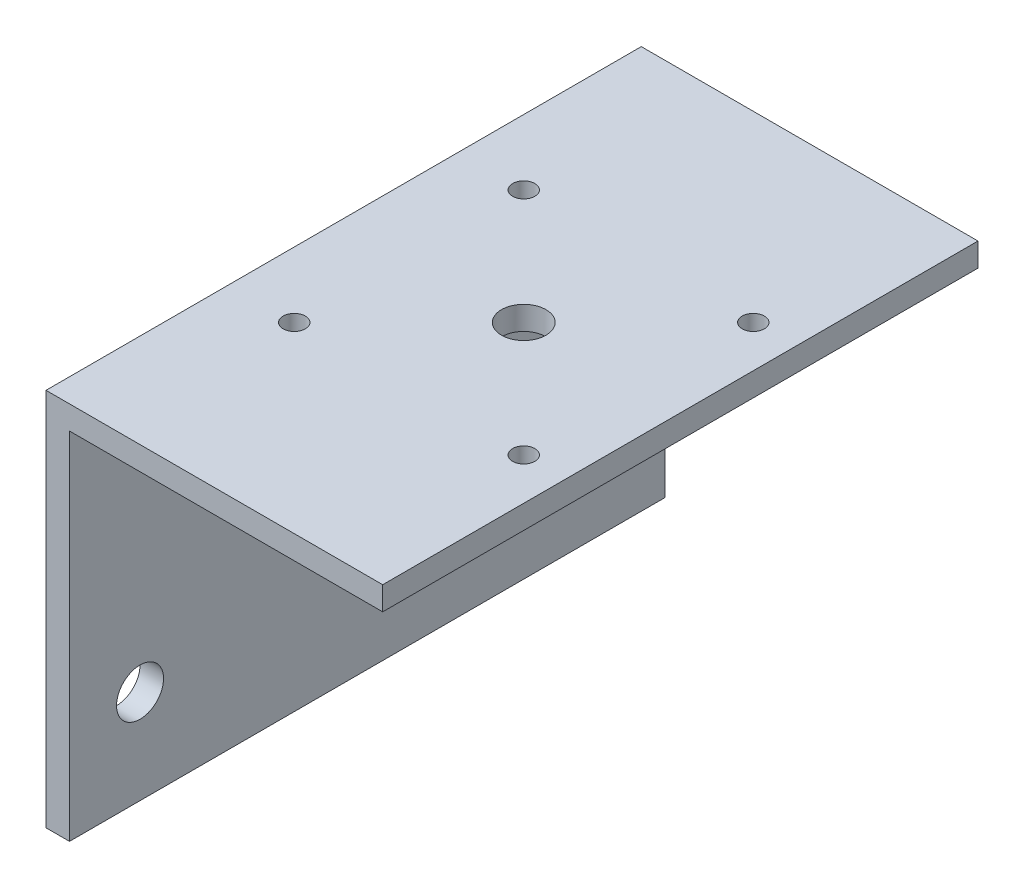
ISO-10303-21;
HEADER;
FILE_DESCRIPTION(('STEP AP214'),'2;1');
FILE_NAME('part.step','',(''),(''),'','','');
FILE_SCHEMA(('AUTOMOTIVE_DESIGN { 1 0 10303 214 1 1 1 1 }'));
ENDSEC;
DATA;
#1=APPLICATION_CONTEXT('core data for automotive mechanical design processes');
#2=APPLICATION_PROTOCOL_DEFINITION('international standard','automotive_design',2000,#1);
#3=PRODUCT_CONTEXT('',#1,'mechanical');
#4=PRODUCT('Part','Part','',(#3));
#5=PRODUCT_RELATED_PRODUCT_CATEGORY('part','',(#4));
#6=PRODUCT_DEFINITION_FORMATION('','',#4);
#7=PRODUCT_DEFINITION_CONTEXT('part definition',#1,'design');
#8=PRODUCT_DEFINITION('design','',#6,#7);
#9=PRODUCT_DEFINITION_SHAPE('','',#8);
#10=(LENGTH_UNIT() NAMED_UNIT(*) SI_UNIT(.MILLI.,.METRE.));
#11=(NAMED_UNIT(*) PLANE_ANGLE_UNIT() SI_UNIT($,.RADIAN.));
#12=(NAMED_UNIT(*) SI_UNIT($,.STERADIAN.) SOLID_ANGLE_UNIT());
#13=UNCERTAINTY_MEASURE_WITH_UNIT(LENGTH_MEASURE(1.E-05),#10,'distance_accuracy_value','');
#14=(GEOMETRIC_REPRESENTATION_CONTEXT(3) GLOBAL_UNCERTAINTY_ASSIGNED_CONTEXT((#13)) GLOBAL_UNIT_ASSIGNED_CONTEXT((#10,
#11,#12)) REPRESENTATION_CONTEXT('',''));
#15=CARTESIAN_POINT('',(0.,0.,0.));
#16=DIRECTION('',(0.,0.,1.));
#17=DIRECTION('',(1.,0.,0.));
#18=AXIS2_PLACEMENT_3D('',#15,#16,#17);
#19=CARTESIAN_POINT('',(0.,0.,80.4));
#20=DIRECTION('',(1.,0.,0.));
#21=DIRECTION('',(0.,0.,-1.));
#22=AXIS2_PLACEMENT_3D('',#19,#20,#21);
#23=PLANE('',#22);
#24=CARTESIAN_POINT('',(0.,12.7,9.52500000000001));
#25=DIRECTION('',(1.,0.,0.));
#26=DIRECTION('',(0.,0.,-1.));
#27=AXIS2_PLACEMENT_3D('',#24,#25,#26);
#28=CIRCLE('',#27,3.175);
#29=CARTESIAN_POINT('',(0.,12.7,6.35000000000001));
#30=VERTEX_POINT('',#29);
#31=EDGE_CURVE('E164',#30,#30,#28,.T.);
#32=ORIENTED_EDGE('',*,*,#31,.T.);
#33=EDGE_LOOP('',(#32));
#34=FACE_BOUND('',#33,.T.);
#35=CARTESIAN_POINT('',(0.,12.7,70.875));
#36=DIRECTION('',(1.,0.,0.));
#37=DIRECTION('',(0.,0.,-1.));
#38=AXIS2_PLACEMENT_3D('',#35,#36,#37);
#39=CIRCLE('',#38,3.175);
#40=CARTESIAN_POINT('',(0.,12.7,67.7));
#41=VERTEX_POINT('',#40);
#42=EDGE_CURVE('E122',#41,#41,#39,.T.);
#43=ORIENTED_EDGE('',*,*,#42,.T.);
#44=EDGE_LOOP('',(#43));
#45=FACE_BOUND('',#44,.T.);
#46=DIRECTION('',(0.,-1.,0.));
#47=VECTOR('',#46,1.);
#48=CARTESIAN_POINT('',(0.,0.,0.));
#49=LINE('',#48,#47);
#50=CARTESIAN_POINT('',(0.,51.175,0.));
#51=VERTEX_POINT('',#50);
#52=CARTESIAN_POINT('',(0.,0.,0.));
#53=VERTEX_POINT('',#52);
#54=EDGE_CURVE('E118',#51,#53,#49,.T.);
#55=ORIENTED_EDGE('',*,*,#54,.T.);
#56=DIRECTION('',(0.,0.,-1.));
#57=VECTOR('',#56,1.);
#58=CARTESIAN_POINT('',(0.,0.,80.4));
#59=LINE('',#58,#57);
#60=CARTESIAN_POINT('',(0.,0.,80.4));
#61=VERTEX_POINT('',#60);
#62=EDGE_CURVE('E11',#61,#53,#59,.T.);
#63=ORIENTED_EDGE('',*,*,#62,.F.);
#64=DIRECTION('',(0.,-1.,0.));
#65=VECTOR('',#64,1.);
#66=CARTESIAN_POINT('',(0.,0.,80.4));
#67=LINE('',#66,#65);
#68=CARTESIAN_POINT('',(0.,51.175,80.4));
#69=VERTEX_POINT('',#68);
#70=EDGE_CURVE('E129',#69,#61,#67,.T.);
#71=ORIENTED_EDGE('',*,*,#70,.F.);
#72=DIRECTION('',(0.,0.,-1.));
#73=VECTOR('',#72,1.);
#74=CARTESIAN_POINT('',(0.,51.175,80.4));
#75=LINE('',#74,#73);
#76=EDGE_CURVE('E114',#69,#51,#75,.T.);
#77=ORIENTED_EDGE('',*,*,#76,.T.);
#78=EDGE_LOOP('',(#55,#63,#71,#77));
#79=FACE_BOUND('',#78,.T.);
#80=ADVANCED_FACE('F34',(#34,#45,#79),#23,.F.);
#81=CARTESIAN_POINT('',(0.,0.,80.4));
#82=DIRECTION('',(0.,1.,0.));
#83=DIRECTION('',(-1.,0.,0.));
#84=AXIS2_PLACEMENT_3D('',#81,#82,#83);
#85=PLANE('',#84);
#86=DIRECTION('',(1.,0.,0.));
#87=VECTOR('',#86,1.);
#88=CARTESIAN_POINT('',(0.,0.,0.));
#89=LINE('',#88,#87);
#90=CARTESIAN_POINT('',(3.175,0.,0.));
#91=VERTEX_POINT('',#90);
#92=EDGE_CURVE('E121',#53,#91,#89,.T.);
#93=ORIENTED_EDGE('',*,*,#92,.T.);
#94=DIRECTION('',(0.,0.,-1.));
#95=VECTOR('',#94,1.);
#96=CARTESIAN_POINT('',(3.175,0.,80.4));
#97=LINE('',#96,#95);
#98=CARTESIAN_POINT('',(3.175,0.,80.4));
#99=VERTEX_POINT('',#98);
#100=EDGE_CURVE('E42',#99,#91,#97,.T.);
#101=ORIENTED_EDGE('',*,*,#100,.F.);
#102=DIRECTION('',(1.,0.,0.));
#103=VECTOR('',#102,1.);
#104=CARTESIAN_POINT('',(0.,0.,80.4));
#105=LINE('',#104,#103);
#106=EDGE_CURVE('E87',#61,#99,#105,.T.);
#107=ORIENTED_EDGE('',*,*,#106,.F.);
#108=ORIENTED_EDGE('',*,*,#62,.T.);
#109=EDGE_LOOP('',(#93,#101,#107,#108));
#110=FACE_BOUND('',#109,.T.);
#111=ADVANCED_FACE('F156',(#110),#85,.F.);
#112=CARTESIAN_POINT('',(3.175,0.,80.4));
#113=DIRECTION('',(-1.,0.,0.));
#114=DIRECTION('',(0.,0.,1.));
#115=AXIS2_PLACEMENT_3D('',#112,#113,#114);
#116=PLANE('',#115);
#117=CARTESIAN_POINT('',(3.175,12.7,9.52500000000001));
#118=DIRECTION('',(1.,0.,0.));
#119=DIRECTION('',(0.,0.,-1.));
#120=AXIS2_PLACEMENT_3D('',#117,#118,#119);
#121=CIRCLE('',#120,3.175);
#122=CARTESIAN_POINT('',(3.175,12.7,6.35000000000001));
#123=VERTEX_POINT('',#122);
#124=EDGE_CURVE('E173',#123,#123,#121,.T.);
#125=ORIENTED_EDGE('',*,*,#124,.F.);
#126=EDGE_LOOP('',(#125));
#127=FACE_BOUND('',#126,.T.);
#128=CARTESIAN_POINT('',(3.175,12.7,70.875));
#129=DIRECTION('',(1.,0.,0.));
#130=DIRECTION('',(0.,0.,-1.));
#131=AXIS2_PLACEMENT_3D('',#128,#129,#130);
#132=CIRCLE('',#131,3.175);
#133=CARTESIAN_POINT('',(3.175,12.7,67.7));
#134=VERTEX_POINT('',#133);
#135=EDGE_CURVE('E168',#134,#134,#132,.T.);
#136=ORIENTED_EDGE('',*,*,#135,.F.);
#137=EDGE_LOOP('',(#136));
#138=FACE_BOUND('',#137,.T.);
#139=DIRECTION('',(0.,1.,0.));
#140=VECTOR('',#139,1.);
#141=CARTESIAN_POINT('',(3.175,0.,0.));
#142=LINE('',#141,#140);
#143=CARTESIAN_POINT('',(3.175,48.,0.));
#144=VERTEX_POINT('',#143);
#145=EDGE_CURVE('E124',#91,#144,#142,.T.);
#146=ORIENTED_EDGE('',*,*,#145,.T.);
#147=DIRECTION('',(0.,0.,-1.));
#148=VECTOR('',#147,1.);
#149=CARTESIAN_POINT('',(3.175,48.,80.4));
#150=LINE('',#149,#148);
#151=CARTESIAN_POINT('',(3.175,48.,80.4));
#152=VERTEX_POINT('',#151);
#153=EDGE_CURVE('E109',#152,#144,#150,.T.);
#154=ORIENTED_EDGE('',*,*,#153,.F.);
#155=DIRECTION('',(0.,1.,0.));
#156=VECTOR('',#155,1.);
#157=CARTESIAN_POINT('',(3.175,0.,80.4));
#158=LINE('',#157,#156);
#159=EDGE_CURVE('E100',#99,#152,#158,.T.);
#160=ORIENTED_EDGE('',*,*,#159,.F.);
#161=ORIENTED_EDGE('',*,*,#100,.T.);
#162=EDGE_LOOP('',(#146,#154,#160,#161));
#163=FACE_BOUND('',#162,.T.);
#164=ADVANCED_FACE('F135',(#127,#138,#163),#116,.F.);
#165=CARTESIAN_POINT('',(45.475,48.,80.4));
#166=DIRECTION('',(0.,1.,0.));
#167=DIRECTION('',(-1.,0.,0.));
#168=AXIS2_PLACEMENT_3D('',#165,#166,#167);
#169=PLANE('',#168);
#170=CARTESIAN_POINT('',(24.325,48.,40.2));
#171=DIRECTION('',(0.,1.,0.));
#172=DIRECTION('',(-1.,0.,0.));
#173=AXIS2_PLACEMENT_3D('',#170,#171,#172);
#174=CIRCLE('',#173,3.);
#175=CARTESIAN_POINT('',(21.325,48.,40.2));
#176=VERTEX_POINT('',#175);
#177=EDGE_CURVE('E203',#176,#176,#174,.T.);
#178=ORIENTED_EDGE('',*,*,#177,.T.);
#179=EDGE_LOOP('',(#178));
#180=FACE_BOUND('',#179,.T.);
#181=CARTESIAN_POINT('',(39.825,48.,24.7));
#182=DIRECTION('',(0.,1.,0.));
#183=DIRECTION('',(-1.,0.,0.));
#184=AXIS2_PLACEMENT_3D('',#181,#182,#183);
#185=CIRCLE('',#184,1.5);
#186=CARTESIAN_POINT('',(38.325,48.,24.7));
#187=VERTEX_POINT('',#186);
#188=EDGE_CURVE('E197',#187,#187,#185,.T.);
#189=ORIENTED_EDGE('',*,*,#188,.T.);
#190=EDGE_LOOP('',(#189));
#191=FACE_BOUND('',#190,.T.);
#192=CARTESIAN_POINT('',(8.825,48.,24.7));
#193=DIRECTION('',(0.,1.,0.));
#194=DIRECTION('',(-1.,0.,0.));
#195=AXIS2_PLACEMENT_3D('',#192,#193,#194);
#196=CIRCLE('',#195,1.5);
#197=CARTESIAN_POINT('',(7.325,48.,24.7));
#198=VERTEX_POINT('',#197);
#199=EDGE_CURVE('E191',#198,#198,#196,.T.);
#200=ORIENTED_EDGE('',*,*,#199,.T.);
#201=EDGE_LOOP('',(#200));
#202=FACE_BOUND('',#201,.T.);
#203=CARTESIAN_POINT('',(8.82500000000001,48.,55.7));
#204=DIRECTION('',(0.,1.,0.));
#205=DIRECTION('',(-1.,0.,0.));
#206=AXIS2_PLACEMENT_3D('',#203,#204,#205);
#207=CIRCLE('',#206,1.5);
#208=CARTESIAN_POINT('',(7.32500000000001,48.,55.7));
#209=VERTEX_POINT('',#208);
#210=EDGE_CURVE('E185',#209,#209,#207,.T.);
#211=ORIENTED_EDGE('',*,*,#210,.T.);
#212=EDGE_LOOP('',(#211));
#213=FACE_BOUND('',#212,.T.);
#214=CARTESIAN_POINT('',(39.825,48.,55.7));
#215=DIRECTION('',(0.,1.,0.));
#216=DIRECTION('',(-1.,0.,0.));
#217=AXIS2_PLACEMENT_3D('',#214,#215,#216);
#218=CIRCLE('',#217,1.5);
#219=CARTESIAN_POINT('',(38.325,48.,55.7));
#220=VERTEX_POINT('',#219);
#221=EDGE_CURVE('E178',#220,#220,#218,.T.);
#222=ORIENTED_EDGE('',*,*,#221,.T.);
#223=EDGE_LOOP('',(#222));
#224=FACE_BOUND('',#223,.T.);
#225=DIRECTION('',(1.,0.,0.));
#226=VECTOR('',#225,1.);
#227=CARTESIAN_POINT('',(45.475,48.,0.));
#228=LINE('',#227,#226);
#229=CARTESIAN_POINT('',(45.475,48.,0.));
#230=VERTEX_POINT('',#229);
#231=EDGE_CURVE('E108',#144,#230,#228,.T.);
#232=ORIENTED_EDGE('',*,*,#231,.T.);
#233=DIRECTION('',(0.,0.,-1.));
#234=VECTOR('',#233,1.);
#235=CARTESIAN_POINT('',(45.475,48.,80.4));
#236=LINE('',#235,#234);
#237=CARTESIAN_POINT('',(45.475,48.,80.4));
#238=VERTEX_POINT('',#237);
#239=EDGE_CURVE('E105',#238,#230,#236,.T.);
#240=ORIENTED_EDGE('',*,*,#239,.F.);
#241=DIRECTION('',(1.,0.,0.));
#242=VECTOR('',#241,1.);
#243=CARTESIAN_POINT('',(45.475,48.,80.4));
#244=LINE('',#243,#242);
#245=EDGE_CURVE('E94',#152,#238,#244,.T.);
#246=ORIENTED_EDGE('',*,*,#245,.F.);
#247=ORIENTED_EDGE('',*,*,#153,.T.);
#248=EDGE_LOOP('',(#232,#240,#246,#247));
#249=FACE_BOUND('',#248,.T.);
#250=ADVANCED_FACE('F106',(#180,#191,#202,#213,#224,#249),#169,.F.);
#251=CARTESIAN_POINT('',(45.475,48.,80.4));
#252=DIRECTION('',(-1.,0.,0.));
#253=DIRECTION('',(0.,0.,1.));
#254=AXIS2_PLACEMENT_3D('',#251,#252,#253);
#255=PLANE('',#254);
#256=DIRECTION('',(0.,1.,0.));
#257=VECTOR('',#256,1.);
#258=CARTESIAN_POINT('',(45.475,48.,0.));
#259=LINE('',#258,#257);
#260=CARTESIAN_POINT('',(45.475,51.175,0.));
#261=VERTEX_POINT('',#260);
#262=EDGE_CURVE('E73',#230,#261,#259,.T.);
#263=ORIENTED_EDGE('',*,*,#262,.T.);
#264=DIRECTION('',(0.,0.,-1.));
#265=VECTOR('',#264,1.);
#266=CARTESIAN_POINT('',(45.475,51.175,80.4));
#267=LINE('',#266,#265);
#268=CARTESIAN_POINT('',(45.475,51.175,80.4));
#269=VERTEX_POINT('',#268);
#270=EDGE_CURVE('E110',#269,#261,#267,.T.);
#271=ORIENTED_EDGE('',*,*,#270,.F.);
#272=DIRECTION('',(0.,1.,0.));
#273=VECTOR('',#272,1.);
#274=CARTESIAN_POINT('',(45.475,48.,80.4));
#275=LINE('',#274,#273);
#276=EDGE_CURVE('E98',#238,#269,#275,.T.);
#277=ORIENTED_EDGE('',*,*,#276,.F.);
#278=ORIENTED_EDGE('',*,*,#239,.T.);
#279=EDGE_LOOP('',(#263,#271,#277,#278));
#280=FACE_BOUND('',#279,.T.);
#281=ADVANCED_FACE('F112',(#280),#255,.F.);
#282=CARTESIAN_POINT('',(0.,51.175,80.4));
#283=DIRECTION('',(0.,-1.,0.));
#284=DIRECTION('',(0.,0.,-1.));
#285=AXIS2_PLACEMENT_3D('',#282,#283,#284);
#286=PLANE('',#285);
#287=CARTESIAN_POINT('',(24.325,51.175,40.2));
#288=DIRECTION('',(0.,1.,0.));
#289=DIRECTION('',(0.,0.,1.));
#290=AXIS2_PLACEMENT_3D('',#287,#288,#289);
#291=CIRCLE('',#290,3.);
#292=CARTESIAN_POINT('',(24.325,51.175,43.2));
#293=VERTEX_POINT('',#292);
#294=EDGE_CURVE('E206',#293,#293,#291,.T.);
#295=ORIENTED_EDGE('',*,*,#294,.F.);
#296=EDGE_LOOP('',(#295));
#297=FACE_BOUND('',#296,.T.);
#298=CARTESIAN_POINT('',(39.825,51.175,24.7));
#299=DIRECTION('',(0.,1.,0.));
#300=DIRECTION('',(0.,0.,1.));
#301=AXIS2_PLACEMENT_3D('',#298,#299,#300);
#302=CIRCLE('',#301,1.5);
#303=CARTESIAN_POINT('',(39.825,51.175,26.2));
#304=VERTEX_POINT('',#303);
#305=EDGE_CURVE('E200',#304,#304,#302,.T.);
#306=ORIENTED_EDGE('',*,*,#305,.F.);
#307=EDGE_LOOP('',(#306));
#308=FACE_BOUND('',#307,.T.);
#309=CARTESIAN_POINT('',(8.825,51.175,24.7));
#310=DIRECTION('',(0.,1.,0.));
#311=DIRECTION('',(0.,0.,1.));
#312=AXIS2_PLACEMENT_3D('',#309,#310,#311);
#313=CIRCLE('',#312,1.5);
#314=CARTESIAN_POINT('',(8.825,51.175,26.2));
#315=VERTEX_POINT('',#314);
#316=EDGE_CURVE('E194',#315,#315,#313,.T.);
#317=ORIENTED_EDGE('',*,*,#316,.F.);
#318=EDGE_LOOP('',(#317));
#319=FACE_BOUND('',#318,.T.);
#320=CARTESIAN_POINT('',(8.82500000000001,51.175,55.7));
#321=DIRECTION('',(0.,1.,0.));
#322=DIRECTION('',(0.,0.,1.));
#323=AXIS2_PLACEMENT_3D('',#320,#321,#322);
#324=CIRCLE('',#323,1.5);
#325=CARTESIAN_POINT('',(8.82500000000001,51.175,57.2));
#326=VERTEX_POINT('',#325);
#327=EDGE_CURVE('E188',#326,#326,#324,.T.);
#328=ORIENTED_EDGE('',*,*,#327,.F.);
#329=EDGE_LOOP('',(#328));
#330=FACE_BOUND('',#329,.T.);
#331=CARTESIAN_POINT('',(39.825,51.175,55.7));
#332=DIRECTION('',(0.,1.,0.));
#333=DIRECTION('',(0.,0.,1.));
#334=AXIS2_PLACEMENT_3D('',#331,#332,#333);
#335=CIRCLE('',#334,1.5);
#336=CARTESIAN_POINT('',(39.825,51.175,57.2));
#337=VERTEX_POINT('',#336);
#338=EDGE_CURVE('E182',#337,#337,#335,.T.);
#339=ORIENTED_EDGE('',*,*,#338,.F.);
#340=EDGE_LOOP('',(#339));
#341=FACE_BOUND('',#340,.T.);
#342=DIRECTION('',(-1.,0.,0.));
#343=VECTOR('',#342,1.);
#344=CARTESIAN_POINT('',(0.,51.175,0.));
#345=LINE('',#344,#343);
#346=EDGE_CURVE('E79',#261,#51,#345,.T.);
#347=ORIENTED_EDGE('',*,*,#346,.T.);
#348=ORIENTED_EDGE('',*,*,#76,.F.);
#349=DIRECTION('',(-1.,0.,0.));
#350=VECTOR('',#349,1.);
#351=CARTESIAN_POINT('',(0.,51.175,80.4));
#352=LINE('',#351,#350);
#353=EDGE_CURVE('E50',#269,#69,#352,.T.);
#354=ORIENTED_EDGE('',*,*,#353,.F.);
#355=ORIENTED_EDGE('',*,*,#270,.T.);
#356=EDGE_LOOP('',(#347,#348,#354,#355));
#357=FACE_BOUND('',#356,.T.);
#358=ADVANCED_FACE('F142',(#297,#308,#319,#330,#341,#357),#286,.F.);
#359=CARTESIAN_POINT('',(0.,0.,80.4));
#360=DIRECTION('',(0.,0.,-1.));
#361=DIRECTION('',(-1.,0.,0.));
#362=AXIS2_PLACEMENT_3D('',#359,#360,#361);
#363=PLANE('',#362);
#364=ORIENTED_EDGE('',*,*,#70,.T.);
#365=ORIENTED_EDGE('',*,*,#106,.T.);
#366=ORIENTED_EDGE('',*,*,#159,.T.);
#367=ORIENTED_EDGE('',*,*,#245,.T.);
#368=ORIENTED_EDGE('',*,*,#276,.T.);
#369=ORIENTED_EDGE('',*,*,#353,.T.);
#370=EDGE_LOOP('',(#364,#365,#366,#367,#368,#369));
#371=FACE_BOUND('',#370,.T.);
#372=ADVANCED_FACE('F96',(#371),#363,.F.);
#373=CARTESIAN_POINT('',(0.,0.,0.));
#374=DIRECTION('',(0.,0.,-1.));
#375=DIRECTION('',(-1.,0.,0.));
#376=AXIS2_PLACEMENT_3D('',#373,#374,#375);
#377=PLANE('',#376);
#378=ORIENTED_EDGE('',*,*,#54,.F.);
#379=ORIENTED_EDGE('',*,*,#346,.F.);
#380=ORIENTED_EDGE('',*,*,#262,.F.);
#381=ORIENTED_EDGE('',*,*,#231,.F.);
#382=ORIENTED_EDGE('',*,*,#145,.F.);
#383=ORIENTED_EDGE('',*,*,#92,.F.);
#384=EDGE_LOOP('',(#378,#379,#380,#381,#382,#383));
#385=FACE_BOUND('',#384,.T.);
#386=ADVANCED_FACE('F138',(#385),#377,.T.);
#387=CARTESIAN_POINT('',(0.,12.7,70.875));
#388=DIRECTION('',(1.,0.,0.));
#389=DIRECTION('',(0.,0.,-1.));
#390=AXIS2_PLACEMENT_3D('',#387,#388,#389);
#391=CYLINDRICAL_SURFACE('',#390,3.175);
#392=ORIENTED_EDGE('',*,*,#42,.F.);
#393=EDGE_LOOP('',(#392));
#394=FACE_BOUND('',#393,.T.);
#395=ORIENTED_EDGE('',*,*,#135,.T.);
#396=EDGE_LOOP('',(#395));
#397=FACE_BOUND('',#396,.T.);
#398=ADVANCED_FACE('F240',(#394,#397),#391,.F.);
#399=CARTESIAN_POINT('',(0.,12.7,9.52500000000001));
#400=DIRECTION('',(1.,0.,0.));
#401=DIRECTION('',(0.,0.,-1.));
#402=AXIS2_PLACEMENT_3D('',#399,#400,#401);
#403=CYLINDRICAL_SURFACE('',#402,3.175);
#404=ORIENTED_EDGE('',*,*,#31,.F.);
#405=EDGE_LOOP('',(#404));
#406=FACE_BOUND('',#405,.T.);
#407=ORIENTED_EDGE('',*,*,#124,.T.);
#408=EDGE_LOOP('',(#407));
#409=FACE_BOUND('',#408,.T.);
#410=ADVANCED_FACE('F230',(#406,#409),#403,.F.);
#411=CARTESIAN_POINT('',(39.825,0.,55.7));
#412=DIRECTION('',(0.,1.,0.));
#413=DIRECTION('',(0.,0.,1.));
#414=AXIS2_PLACEMENT_3D('',#411,#412,#413);
#415=CYLINDRICAL_SURFACE('',#414,1.5);
#416=ORIENTED_EDGE('',*,*,#338,.T.);
#417=EDGE_LOOP('',(#416));
#418=FACE_BOUND('',#417,.T.);
#419=ORIENTED_EDGE('',*,*,#221,.F.);
#420=EDGE_LOOP('',(#419));
#421=FACE_BOUND('',#420,.T.);
#422=ADVANCED_FACE('F227',(#418,#421),#415,.F.);
#423=CARTESIAN_POINT('',(8.82500000000001,0.,55.7));
#424=DIRECTION('',(0.,1.,0.));
#425=DIRECTION('',(0.,0.,1.));
#426=AXIS2_PLACEMENT_3D('',#423,#424,#425);
#427=CYLINDRICAL_SURFACE('',#426,1.5);
#428=ORIENTED_EDGE('',*,*,#327,.T.);
#429=EDGE_LOOP('',(#428));
#430=FACE_BOUND('',#429,.T.);
#431=ORIENTED_EDGE('',*,*,#210,.F.);
#432=EDGE_LOOP('',(#431));
#433=FACE_BOUND('',#432,.T.);
#434=ADVANCED_FACE('F229',(#430,#433),#427,.F.);
#435=CARTESIAN_POINT('',(8.825,0.,24.7));
#436=DIRECTION('',(0.,1.,0.));
#437=DIRECTION('',(0.,0.,1.));
#438=AXIS2_PLACEMENT_3D('',#435,#436,#437);
#439=CYLINDRICAL_SURFACE('',#438,1.5);
#440=ORIENTED_EDGE('',*,*,#316,.T.);
#441=EDGE_LOOP('',(#440));
#442=FACE_BOUND('',#441,.T.);
#443=ORIENTED_EDGE('',*,*,#199,.F.);
#444=EDGE_LOOP('',(#443));
#445=FACE_BOUND('',#444,.T.);
#446=ADVANCED_FACE('F237',(#442,#445),#439,.F.);
#447=CARTESIAN_POINT('',(39.825,0.,24.7));
#448=DIRECTION('',(0.,1.,0.));
#449=DIRECTION('',(0.,0.,1.));
#450=AXIS2_PLACEMENT_3D('',#447,#448,#449);
#451=CYLINDRICAL_SURFACE('',#450,1.5);
#452=ORIENTED_EDGE('',*,*,#305,.T.);
#453=EDGE_LOOP('',(#452));
#454=FACE_BOUND('',#453,.T.);
#455=ORIENTED_EDGE('',*,*,#188,.F.);
#456=EDGE_LOOP('',(#455));
#457=FACE_BOUND('',#456,.T.);
#458=ADVANCED_FACE('F212',(#454,#457),#451,.F.);
#459=CARTESIAN_POINT('',(24.325,0.,40.2));
#460=DIRECTION('',(0.,1.,0.));
#461=DIRECTION('',(0.,0.,1.));
#462=AXIS2_PLACEMENT_3D('',#459,#460,#461);
#463=CYLINDRICAL_SURFACE('',#462,3.);
#464=ORIENTED_EDGE('',*,*,#294,.T.);
#465=EDGE_LOOP('',(#464));
#466=FACE_BOUND('',#465,.T.);
#467=ORIENTED_EDGE('',*,*,#177,.F.);
#468=EDGE_LOOP('',(#467));
#469=FACE_BOUND('',#468,.T.);
#470=ADVANCED_FACE('F209',(#466,#469),#463,.F.);
#471=CLOSED_SHELL('',(#80,#111,#164,#250,#281,#358,#372,#386,#398,#410,#422,#434,#446,#458,#470));
#472=MANIFOLD_SOLID_BREP('B2',#471);
#473=ADVANCED_BREP_SHAPE_REPRESENTATION('',(#18,#472),#14);
#474=SHAPE_DEFINITION_REPRESENTATION(#9,#473);
ENDSEC;
END-ISO-10303-21;
